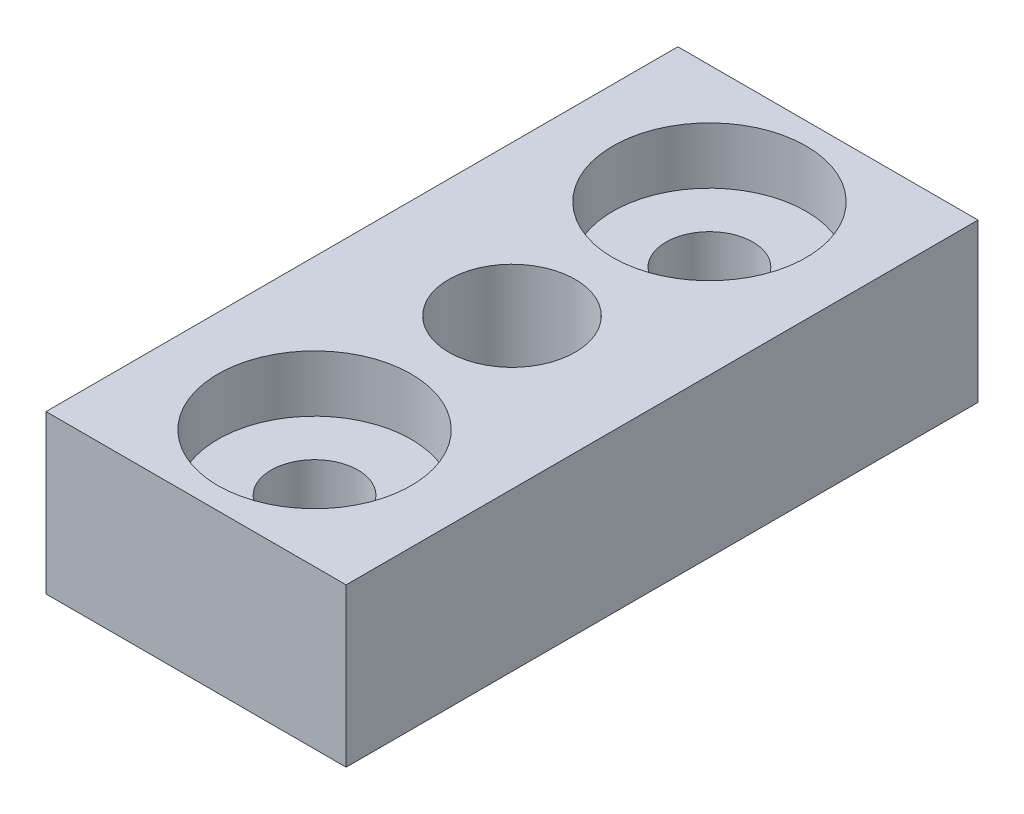
ISO-10303-21;
HEADER;
FILE_DESCRIPTION(('STEP AP214'),'2;1');
FILE_NAME('part.step','',(''),(''),'','','');
FILE_SCHEMA(('AUTOMOTIVE_DESIGN { 1 0 10303 214 1 1 1 1 }'));
ENDSEC;
DATA;
#1=APPLICATION_CONTEXT('core data for automotive mechanical design processes');
#2=APPLICATION_PROTOCOL_DEFINITION('international standard','automotive_design',2000,#1);
#3=PRODUCT_CONTEXT('',#1,'mechanical');
#4=PRODUCT('Part','Part','',(#3));
#5=PRODUCT_RELATED_PRODUCT_CATEGORY('part','',(#4));
#6=PRODUCT_DEFINITION_FORMATION('','',#4);
#7=PRODUCT_DEFINITION_CONTEXT('part definition',#1,'design');
#8=PRODUCT_DEFINITION('design','',#6,#7);
#9=PRODUCT_DEFINITION_SHAPE('','',#8);
#10=(LENGTH_UNIT() NAMED_UNIT(*) SI_UNIT(.MILLI.,.METRE.));
#11=(NAMED_UNIT(*) PLANE_ANGLE_UNIT() SI_UNIT($,.RADIAN.));
#12=(NAMED_UNIT(*) SI_UNIT($,.STERADIAN.) SOLID_ANGLE_UNIT());
#13=UNCERTAINTY_MEASURE_WITH_UNIT(LENGTH_MEASURE(1.E-05),#10,'distance_accuracy_value','');
#14=(GEOMETRIC_REPRESENTATION_CONTEXT(3) GLOBAL_UNCERTAINTY_ASSIGNED_CONTEXT((#13)) GLOBAL_UNIT_ASSIGNED_CONTEXT((#10,
#11,#12)) REPRESENTATION_CONTEXT('',''));
#15=CARTESIAN_POINT('',(0.,0.,0.));
#16=DIRECTION('',(0.,0.,1.));
#17=DIRECTION('',(1.,0.,0.));
#18=AXIS2_PLACEMENT_3D('',#15,#16,#17);
#19=CARTESIAN_POINT('',(0.,10.,0.));
#20=DIRECTION('',(0.,1.,0.));
#21=DIRECTION('',(0.,0.,1.));
#22=AXIS2_PLACEMENT_3D('',#19,#20,#21);
#23=PLANE('',#22);
#24=CARTESIAN_POINT('',(0.,10.,-12.5));
#25=DIRECTION('',(0.,1.,0.));
#26=DIRECTION('',(0.,0.,1.));
#27=AXIS2_PLACEMENT_3D('',#24,#25,#26);
#28=CIRCLE('',#27,6.12);
#29=CARTESIAN_POINT('',(0.,10.,-6.38));
#30=VERTEX_POINT('',#29);
#31=EDGE_CURVE('E140',#30,#30,#28,.T.);
#32=ORIENTED_EDGE('',*,*,#31,.F.);
#33=EDGE_LOOP('',(#32));
#34=FACE_BOUND('',#33,.T.);
#35=CARTESIAN_POINT('',(0.,10.,12.5));
#36=DIRECTION('',(0.,1.,0.));
#37=DIRECTION('',(0.,0.,1.));
#38=AXIS2_PLACEMENT_3D('',#35,#36,#37);
#39=CIRCLE('',#38,6.12);
#40=CARTESIAN_POINT('',(0.,10.,18.62));
#41=VERTEX_POINT('',#40);
#42=EDGE_CURVE('E128',#41,#41,#39,.T.);
#43=ORIENTED_EDGE('',*,*,#42,.F.);
#44=EDGE_LOOP('',(#43));
#45=FACE_BOUND('',#44,.T.);
#46=DIRECTION('',(0.,0.,1.));
#47=VECTOR('',#46,1.);
#48=CARTESIAN_POINT('',(-9.5,10.,-20.));
#49=LINE('',#48,#47);
#50=CARTESIAN_POINT('',(-9.5,10.,-20.));
#51=VERTEX_POINT('',#50);
#52=CARTESIAN_POINT('',(-9.5,10.,20.));
#53=VERTEX_POINT('',#52);
#54=EDGE_CURVE('E87',#51,#53,#49,.T.);
#55=ORIENTED_EDGE('',*,*,#54,.T.);
#56=DIRECTION('',(1.,0.,0.));
#57=VECTOR('',#56,1.);
#58=CARTESIAN_POINT('',(-9.5,10.,20.));
#59=LINE('',#58,#57);
#60=CARTESIAN_POINT('',(9.5,10.,20.));
#61=VERTEX_POINT('',#60);
#62=EDGE_CURVE('E82',#53,#61,#59,.T.);
#63=ORIENTED_EDGE('',*,*,#62,.T.);
#64=DIRECTION('',(0.,0.,-1.));
#65=VECTOR('',#64,1.);
#66=CARTESIAN_POINT('',(9.5,10.,-20.));
#67=LINE('',#66,#65);
#68=CARTESIAN_POINT('',(9.5,10.,-20.));
#69=VERTEX_POINT('',#68);
#70=EDGE_CURVE('E85',#61,#69,#67,.T.);
#71=ORIENTED_EDGE('',*,*,#70,.T.);
#72=DIRECTION('',(-1.,0.,0.));
#73=VECTOR('',#72,1.);
#74=CARTESIAN_POINT('',(-9.5,10.,-20.));
#75=LINE('',#74,#73);
#76=EDGE_CURVE('E52',#69,#51,#75,.T.);
#77=ORIENTED_EDGE('',*,*,#76,.T.);
#78=EDGE_LOOP('',(#55,#63,#71,#77));
#79=FACE_BOUND('',#78,.T.);
#80=CARTESIAN_POINT('',(0.,10.,0.));
#81=DIRECTION('',(0.,1.,0.));
#82=DIRECTION('',(0.,0.,1.));
#83=AXIS2_PLACEMENT_3D('',#80,#81,#82);
#84=CIRCLE('',#83,4.);
#85=CARTESIAN_POINT('',(0.,10.,4.));
#86=VERTEX_POINT('',#85);
#87=EDGE_CURVE('E102',#86,#86,#84,.T.);
#88=ORIENTED_EDGE('',*,*,#87,.F.);
#89=EDGE_LOOP('',(#88));
#90=FACE_BOUND('',#89,.T.);
#91=ADVANCED_FACE('F35',(#34,#45,#79,#90),#23,.T.);
#92=CARTESIAN_POINT('',(0.,0.,0.));
#93=DIRECTION('',(0.,1.,0.));
#94=DIRECTION('',(0.,0.,1.));
#95=AXIS2_PLACEMENT_3D('',#92,#93,#94);
#96=PLANE('',#95);
#97=CARTESIAN_POINT('',(0.,0.,-12.5));
#98=DIRECTION('',(0.,1.,0.));
#99=DIRECTION('',(0.,0.,1.));
#100=AXIS2_PLACEMENT_3D('',#97,#98,#99);
#101=CIRCLE('',#100,2.75);
#102=CARTESIAN_POINT('',(0.,0.,-9.75));
#103=VERTEX_POINT('',#102);
#104=EDGE_CURVE('E131',#103,#103,#101,.T.);
#105=ORIENTED_EDGE('',*,*,#104,.T.);
#106=EDGE_LOOP('',(#105));
#107=FACE_BOUND('',#106,.T.);
#108=CARTESIAN_POINT('',(0.,0.,12.5));
#109=DIRECTION('',(0.,1.,0.));
#110=DIRECTION('',(0.,0.,1.));
#111=AXIS2_PLACEMENT_3D('',#108,#109,#110);
#112=CIRCLE('',#111,2.75);
#113=CARTESIAN_POINT('',(0.,0.,15.25));
#114=VERTEX_POINT('',#113);
#115=EDGE_CURVE('E117',#114,#114,#112,.T.);
#116=ORIENTED_EDGE('',*,*,#115,.T.);
#117=EDGE_LOOP('',(#116));
#118=FACE_BOUND('',#117,.T.);
#119=DIRECTION('',(0.,0.,1.));
#120=VECTOR('',#119,1.);
#121=CARTESIAN_POINT('',(-9.5,0.,-20.));
#122=LINE('',#121,#120);
#123=CARTESIAN_POINT('',(-9.5,0.,-20.));
#124=VERTEX_POINT('',#123);
#125=CARTESIAN_POINT('',(-9.5,0.,20.));
#126=VERTEX_POINT('',#125);
#127=EDGE_CURVE('E99',#124,#126,#122,.T.);
#128=ORIENTED_EDGE('',*,*,#127,.F.);
#129=DIRECTION('',(-1.,0.,0.));
#130=VECTOR('',#129,1.);
#131=CARTESIAN_POINT('',(-9.5,0.,-20.));
#132=LINE('',#131,#130);
#133=CARTESIAN_POINT('',(9.5,0.,-20.));
#134=VERTEX_POINT('',#133);
#135=EDGE_CURVE('E75',#134,#124,#132,.T.);
#136=ORIENTED_EDGE('',*,*,#135,.F.);
#137=DIRECTION('',(0.,0.,-1.));
#138=VECTOR('',#137,1.);
#139=CARTESIAN_POINT('',(9.5,0.,-20.));
#140=LINE('',#139,#138);
#141=CARTESIAN_POINT('',(9.5,0.,20.));
#142=VERTEX_POINT('',#141);
#143=EDGE_CURVE('E69',#142,#134,#140,.T.);
#144=ORIENTED_EDGE('',*,*,#143,.F.);
#145=DIRECTION('',(1.,0.,0.));
#146=VECTOR('',#145,1.);
#147=CARTESIAN_POINT('',(-9.5,0.,20.));
#148=LINE('',#147,#146);
#149=EDGE_CURVE('E91',#126,#142,#148,.T.);
#150=ORIENTED_EDGE('',*,*,#149,.F.);
#151=EDGE_LOOP('',(#128,#136,#144,#150));
#152=FACE_BOUND('',#151,.T.);
#153=CARTESIAN_POINT('',(0.,0.,0.));
#154=DIRECTION('',(0.,1.,0.));
#155=DIRECTION('',(0.,0.,1.));
#156=AXIS2_PLACEMENT_3D('',#153,#154,#155);
#157=CIRCLE('',#156,4.);
#158=CARTESIAN_POINT('',(0.,0.,4.));
#159=VERTEX_POINT('',#158);
#160=EDGE_CURVE('E114',#159,#159,#157,.T.);
#161=ORIENTED_EDGE('',*,*,#160,.T.);
#162=EDGE_LOOP('',(#161));
#163=FACE_BOUND('',#162,.T.);
#164=ADVANCED_FACE('F110',(#107,#118,#152,#163),#96,.F.);
#165=CARTESIAN_POINT('',(-9.5,10.,-20.));
#166=DIRECTION('',(1.,0.,0.));
#167=DIRECTION('',(0.,0.,-1.));
#168=AXIS2_PLACEMENT_3D('',#165,#166,#167);
#169=PLANE('',#168);
#170=ORIENTED_EDGE('',*,*,#127,.T.);
#171=DIRECTION('',(0.,-1.,0.));
#172=VECTOR('',#171,1.);
#173=CARTESIAN_POINT('',(-9.5,10.,20.));
#174=LINE('',#173,#172);
#175=EDGE_CURVE('E11',#53,#126,#174,.T.);
#176=ORIENTED_EDGE('',*,*,#175,.F.);
#177=ORIENTED_EDGE('',*,*,#54,.F.);
#178=DIRECTION('',(0.,-1.,0.));
#179=VECTOR('',#178,1.);
#180=CARTESIAN_POINT('',(-9.5,10.,-20.));
#181=LINE('',#180,#179);
#182=EDGE_CURVE('E95',#51,#124,#181,.T.);
#183=ORIENTED_EDGE('',*,*,#182,.T.);
#184=EDGE_LOOP('',(#170,#176,#177,#183));
#185=FACE_BOUND('',#184,.T.);
#186=ADVANCED_FACE('F37',(#185),#169,.F.);
#187=CARTESIAN_POINT('',(-9.5,10.,20.));
#188=DIRECTION('',(0.,0.,-1.));
#189=DIRECTION('',(-1.,0.,0.));
#190=AXIS2_PLACEMENT_3D('',#187,#188,#189);
#191=PLANE('',#190);
#192=ORIENTED_EDGE('',*,*,#149,.T.);
#193=DIRECTION('',(0.,-1.,0.));
#194=VECTOR('',#193,1.);
#195=CARTESIAN_POINT('',(9.5,10.,20.));
#196=LINE('',#195,#194);
#197=EDGE_CURVE('E44',#61,#142,#196,.T.);
#198=ORIENTED_EDGE('',*,*,#197,.F.);
#199=ORIENTED_EDGE('',*,*,#62,.F.);
#200=ORIENTED_EDGE('',*,*,#175,.T.);
#201=EDGE_LOOP('',(#192,#198,#199,#200));
#202=FACE_BOUND('',#201,.T.);
#203=ADVANCED_FACE('F90',(#202),#191,.F.);
#204=CARTESIAN_POINT('',(9.5,10.,-20.));
#205=DIRECTION('',(-1.,0.,0.));
#206=DIRECTION('',(0.,0.,1.));
#207=AXIS2_PLACEMENT_3D('',#204,#205,#206);
#208=PLANE('',#207);
#209=ORIENTED_EDGE('',*,*,#143,.T.);
#210=DIRECTION('',(0.,-1.,0.));
#211=VECTOR('',#210,1.);
#212=CARTESIAN_POINT('',(9.5,10.,-20.));
#213=LINE('',#212,#211);
#214=EDGE_CURVE('E92',#69,#134,#213,.T.);
#215=ORIENTED_EDGE('',*,*,#214,.F.);
#216=ORIENTED_EDGE('',*,*,#70,.F.);
#217=ORIENTED_EDGE('',*,*,#197,.T.);
#218=EDGE_LOOP('',(#209,#215,#216,#217));
#219=FACE_BOUND('',#218,.T.);
#220=ADVANCED_FACE('F93',(#219),#208,.F.);
#221=CARTESIAN_POINT('',(-9.5,10.,-20.));
#222=DIRECTION('',(0.,0.,1.));
#223=DIRECTION('',(1.,0.,0.));
#224=AXIS2_PLACEMENT_3D('',#221,#222,#223);
#225=PLANE('',#224);
#226=ORIENTED_EDGE('',*,*,#135,.T.);
#227=ORIENTED_EDGE('',*,*,#182,.F.);
#228=ORIENTED_EDGE('',*,*,#76,.F.);
#229=ORIENTED_EDGE('',*,*,#214,.T.);
#230=EDGE_LOOP('',(#226,#227,#228,#229));
#231=FACE_BOUND('',#230,.T.);
#232=ADVANCED_FACE('F107',(#231),#225,.F.);
#233=CARTESIAN_POINT('',(0.,10.,0.));
#234=DIRECTION('',(0.,-1.,0.));
#235=DIRECTION('',(0.,0.,-1.));
#236=AXIS2_PLACEMENT_3D('',#233,#234,#235);
#237=CYLINDRICAL_SURFACE('',#236,4.);
#238=ORIENTED_EDGE('',*,*,#87,.T.);
#239=EDGE_LOOP('',(#238));
#240=FACE_BOUND('',#239,.T.);
#241=ORIENTED_EDGE('',*,*,#160,.F.);
#242=EDGE_LOOP('',(#241));
#243=FACE_BOUND('',#242,.T.);
#244=ADVANCED_FACE('F172',(#240,#243),#237,.F.);
#245=CARTESIAN_POINT('',(0.,10.,12.5));
#246=DIRECTION('',(0.,1.,0.));
#247=DIRECTION('',(0.,0.,1.));
#248=AXIS2_PLACEMENT_3D('',#245,#246,#247);
#249=CYLINDRICAL_SURFACE('',#248,2.75);
#250=ORIENTED_EDGE('',*,*,#115,.F.);
#251=EDGE_LOOP('',(#250));
#252=FACE_BOUND('',#251,.T.);
#253=CARTESIAN_POINT('',(0.,6.42,12.5));
#254=DIRECTION('',(0.,1.,0.));
#255=DIRECTION('',(0.,0.,1.));
#256=AXIS2_PLACEMENT_3D('',#253,#254,#255);
#257=CIRCLE('',#256,2.75);
#258=CARTESIAN_POINT('',(0.,6.42,15.25));
#259=VERTEX_POINT('',#258);
#260=EDGE_CURVE('E122',#259,#259,#257,.T.);
#261=ORIENTED_EDGE('',*,*,#260,.T.);
#262=EDGE_LOOP('',(#261));
#263=FACE_BOUND('',#262,.T.);
#264=ADVANCED_FACE('F164',(#252,#263),#249,.F.);
#265=CARTESIAN_POINT('',(2.75,6.42,12.5));
#266=DIRECTION('',(0.,-1.,0.));
#267=DIRECTION('',(0.,0.,-1.));
#268=AXIS2_PLACEMENT_3D('',#265,#266,#267);
#269=PLANE('',#268);
#270=ORIENTED_EDGE('',*,*,#260,.F.);
#271=EDGE_LOOP('',(#270));
#272=FACE_BOUND('',#271,.T.);
#273=CARTESIAN_POINT('',(0.,6.42,12.5));
#274=DIRECTION('',(0.,1.,0.));
#275=DIRECTION('',(0.,0.,1.));
#276=AXIS2_PLACEMENT_3D('',#273,#274,#275);
#277=CIRCLE('',#276,6.12);
#278=CARTESIAN_POINT('',(0.,6.42,18.62));
#279=VERTEX_POINT('',#278);
#280=EDGE_CURVE('E125',#279,#279,#277,.T.);
#281=ORIENTED_EDGE('',*,*,#280,.T.);
#282=EDGE_LOOP('',(#281));
#283=FACE_BOUND('',#282,.T.);
#284=ADVANCED_FACE('F154',(#272,#283),#269,.F.);
#285=CARTESIAN_POINT('',(0.,10.,12.5));
#286=DIRECTION('',(0.,1.,0.));
#287=DIRECTION('',(0.,0.,1.));
#288=AXIS2_PLACEMENT_3D('',#285,#286,#287);
#289=CYLINDRICAL_SURFACE('',#288,6.12);
#290=ORIENTED_EDGE('',*,*,#280,.F.);
#291=EDGE_LOOP('',(#290));
#292=FACE_BOUND('',#291,.T.);
#293=ORIENTED_EDGE('',*,*,#42,.T.);
#294=EDGE_LOOP('',(#293));
#295=FACE_BOUND('',#294,.T.);
#296=ADVANCED_FACE('F151',(#292,#295),#289,.F.);
#297=CARTESIAN_POINT('',(0.,10.,-12.5));
#298=DIRECTION('',(0.,1.,0.));
#299=DIRECTION('',(0.,0.,1.));
#300=AXIS2_PLACEMENT_3D('',#297,#298,#299);
#301=CYLINDRICAL_SURFACE('',#300,2.75);
#302=ORIENTED_EDGE('',*,*,#104,.F.);
#303=EDGE_LOOP('',(#302));
#304=FACE_BOUND('',#303,.T.);
#305=CARTESIAN_POINT('',(0.,6.42,-12.5));
#306=DIRECTION('',(0.,1.,0.));
#307=DIRECTION('',(0.,0.,1.));
#308=AXIS2_PLACEMENT_3D('',#305,#306,#307);
#309=CIRCLE('',#308,2.75);
#310=CARTESIAN_POINT('',(0.,6.42,-9.75));
#311=VERTEX_POINT('',#310);
#312=EDGE_CURVE('E134',#311,#311,#309,.T.);
#313=ORIENTED_EDGE('',*,*,#312,.T.);
#314=EDGE_LOOP('',(#313));
#315=FACE_BOUND('',#314,.T.);
#316=ADVANCED_FACE('F153',(#304,#315),#301,.F.);
#317=CARTESIAN_POINT('',(2.75,6.42,-12.5));
#318=DIRECTION('',(0.,-1.,0.));
#319=DIRECTION('',(0.,0.,-1.));
#320=AXIS2_PLACEMENT_3D('',#317,#318,#319);
#321=PLANE('',#320);
#322=ORIENTED_EDGE('',*,*,#312,.F.);
#323=EDGE_LOOP('',(#322));
#324=FACE_BOUND('',#323,.T.);
#325=CARTESIAN_POINT('',(0.,6.42,-12.5));
#326=DIRECTION('',(0.,1.,0.));
#327=DIRECTION('',(0.,0.,1.));
#328=AXIS2_PLACEMENT_3D('',#325,#326,#327);
#329=CIRCLE('',#328,6.12);
#330=CARTESIAN_POINT('',(0.,6.42,-6.38));
#331=VERTEX_POINT('',#330);
#332=EDGE_CURVE('E137',#331,#331,#329,.T.);
#333=ORIENTED_EDGE('',*,*,#332,.T.);
#334=EDGE_LOOP('',(#333));
#335=FACE_BOUND('',#334,.T.);
#336=ADVANCED_FACE('F161',(#324,#335),#321,.F.);
#337=CARTESIAN_POINT('',(0.,10.,-12.5));
#338=DIRECTION('',(0.,1.,0.));
#339=DIRECTION('',(0.,0.,1.));
#340=AXIS2_PLACEMENT_3D('',#337,#338,#339);
#341=CYLINDRICAL_SURFACE('',#340,6.12);
#342=ORIENTED_EDGE('',*,*,#332,.F.);
#343=EDGE_LOOP('',(#342));
#344=FACE_BOUND('',#343,.T.);
#345=ORIENTED_EDGE('',*,*,#31,.T.);
#346=EDGE_LOOP('',(#345));
#347=FACE_BOUND('',#346,.T.);
#348=ADVANCED_FACE('F144',(#344,#347),#341,.F.);
#349=CLOSED_SHELL('',(#91,#164,#186,#203,#220,#232,#244,#264,#284,#296,#316,#336,#348));
#350=MANIFOLD_SOLID_BREP('B2',#349);
#351=ADVANCED_BREP_SHAPE_REPRESENTATION('',(#18,#350),#14);
#352=SHAPE_DEFINITION_REPRESENTATION(#9,#351);
ENDSEC;
END-ISO-10303-21;
